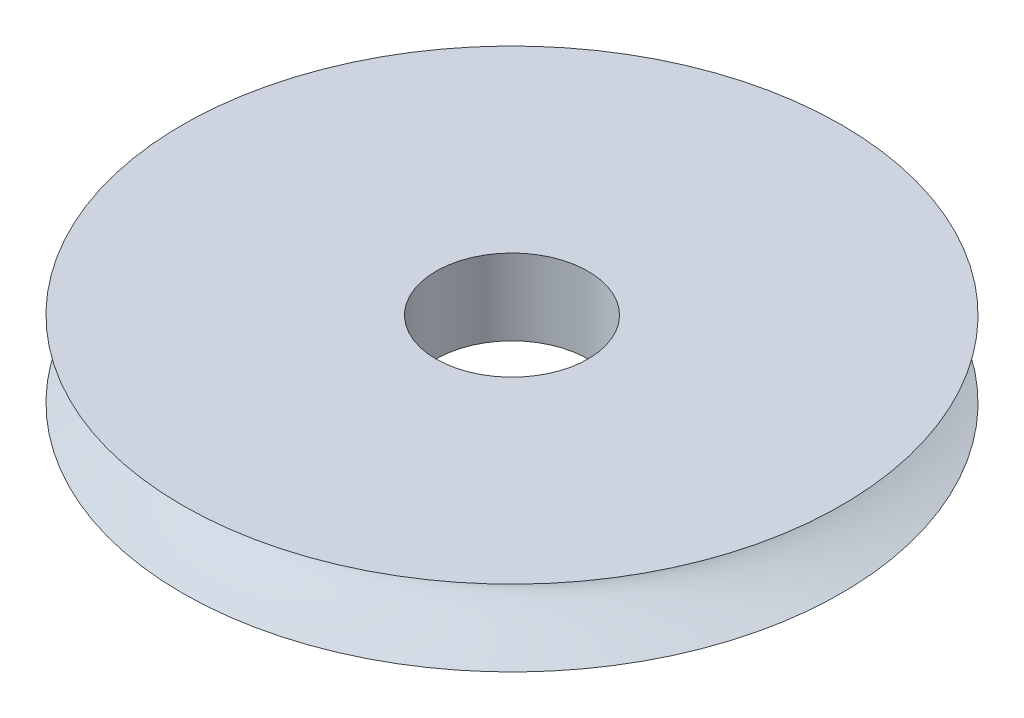
ISO-10303-21;
HEADER;
FILE_DESCRIPTION(('STEP AP214'),'2;1');
FILE_NAME('part.step','',(''),(''),'','','');
FILE_SCHEMA(('AUTOMOTIVE_DESIGN { 1 0 10303 214 1 1 1 1 }'));
ENDSEC;
DATA;
#1=APPLICATION_CONTEXT('core data for automotive mechanical design processes');
#2=APPLICATION_PROTOCOL_DEFINITION('international standard','automotive_design',2000,#1);
#3=PRODUCT_CONTEXT('',#1,'mechanical');
#4=PRODUCT('Part','Part','',(#3));
#5=PRODUCT_RELATED_PRODUCT_CATEGORY('part','',(#4));
#6=PRODUCT_DEFINITION_FORMATION('','',#4);
#7=PRODUCT_DEFINITION_CONTEXT('part definition',#1,'design');
#8=PRODUCT_DEFINITION('design','',#6,#7);
#9=PRODUCT_DEFINITION_SHAPE('','',#8);
#10=(LENGTH_UNIT() NAMED_UNIT(*) SI_UNIT(.MILLI.,.METRE.));
#11=(NAMED_UNIT(*) PLANE_ANGLE_UNIT() SI_UNIT($,.RADIAN.));
#12=(NAMED_UNIT(*) SI_UNIT($,.STERADIAN.) SOLID_ANGLE_UNIT());
#13=UNCERTAINTY_MEASURE_WITH_UNIT(LENGTH_MEASURE(1.E-05),#10,'distance_accuracy_value','');
#14=(GEOMETRIC_REPRESENTATION_CONTEXT(3) GLOBAL_UNCERTAINTY_ASSIGNED_CONTEXT((#13)) GLOBAL_UNIT_ASSIGNED_CONTEXT((#10,
#11,#12)) REPRESENTATION_CONTEXT('',''));
#15=CARTESIAN_POINT('',(0.,0.,0.));
#16=DIRECTION('',(0.,0.,1.));
#17=DIRECTION('',(1.,0.,0.));
#18=AXIS2_PLACEMENT_3D('',#15,#16,#17);
#19=CARTESIAN_POINT('',(-4.7030891410279,0.0646365379077759,0.));
#20=CARTESIAN_POINT('',(0.132127884853617,-1.29416630680979,0.));
#21=CARTESIAN_POINT('',(-4.7030891410279,-2.93536346209222,0.));
#22=B_SPLINE_CURVE_WITH_KNOTS('',2,(#19,#20,#21),.UNSPECIFIED.,.F.,.F.,(3,3),(0.,1.),.UNSPECIFIED.);
#23=CARTESIAN_POINT('',(8.2969108589721,-2.93536346209222,0.));
#24=DIRECTION('',(0.,-1.,0.));
#25=AXIS1_PLACEMENT('',#23,#24);
#26=SURFACE_OF_REVOLUTION('',#22,#25);
#27=CARTESIAN_POINT('',(0.845458704228537,-1.55002649245806,7.5654333756056));
#28=CARTESIAN_POINT('',(0.847613144882339,-1.52860845002893,7.55579344749865));
#29=CARTESIAN_POINT('',(0.849600075522715,-1.50651041165991,7.54761473258343));
#30=CARTESIAN_POINT('',(0.852998868016188,-1.46124210806276,7.53487370081712));
#31=CARTESIAN_POINT('',(0.854411277726282,-1.43807288789859,7.53030793474944));
#32=CARTESIAN_POINT('',(0.856465254339281,-1.39109551951572,7.52529166505001));
#33=CARTESIAN_POINT('',(0.857101858663785,-1.36728424364092,7.52486753444354));
#34=CARTESIAN_POINT('',(0.857494946830042,-1.31997728190922,7.52828459824152));
#35=CARTESIAN_POINT('',(0.857251871723618,-1.29648144382842,7.53212365450922));
#36=CARTESIAN_POINT('',(0.856101229430046,-1.25576533748203,7.54229606994728));
#37=CARTESIAN_POINT('',(0.855358171437151,-1.2383377642586,7.54785913782257));
#38=CARTESIAN_POINT('',(0.852272802485811,-1.1830354662139,7.56909491146743));
#39=CARTESIAN_POINT('',(0.849091146019609,-1.14671409916213,7.58873172971374));
#40=CARTESIAN_POINT('',(0.841597598067911,-1.07836451372547,7.63442285222921));
#41=CARTESIAN_POINT('',(0.837276286515073,-1.04637560736522,7.66053052913932));
#42=CARTESIAN_POINT('',(0.829318989107059,-0.99286445150994,7.71057324787126));
#43=CARTESIAN_POINT('',(0.825740534107372,-0.970585290760509,7.73372916423974));
#44=CARTESIAN_POINT('',(0.818699519316215,-0.928033804945424,7.78185244542057));
#45=CARTESIAN_POINT('',(0.815237056832219,-0.907763138237736,7.80682127811701));
#46=CARTESIAN_POINT('',(0.808693485596487,-0.868910745000397,7.85818586726802));
#47=CARTESIAN_POINT('',(0.805613456152661,-0.850333836140016,7.88458537310411));
#48=CARTESIAN_POINT('',(0.800114354004881,-0.814715840619906,7.93846871640145));
#49=CARTESIAN_POINT('',(0.797695386573212,-0.797674998863812,7.96595272577029));
#50=CARTESIAN_POINT('',(0.793529862681783,-0.762580192797241,8.02591453099929));
#51=CARTESIAN_POINT('',(0.791934654707723,-0.744746207252042,8.05853199199379));
#52=CARTESIAN_POINT('',(0.790559435902147,-0.710785993187861,8.1247400904267));
#53=CARTESIAN_POINT('',(0.790781576963576,-0.694661812099587,8.15833183460922));
#54=CARTESIAN_POINT('',(0.793802762397922,-0.664311688585677,8.22593346490742));
#55=CARTESIAN_POINT('',(0.796580655670341,-0.650071261275024,8.25993766146361));
#56=CARTESIAN_POINT('',(0.805774891559779,-0.623601932968884,8.32820246241864));
#57=CARTESIAN_POINT('',(0.81218110036756,-0.611367551333789,8.36246209151635));
#58=CARTESIAN_POINT('',(0.826921285429864,-0.593512263264308,8.41792428854368));
#59=CARTESIAN_POINT('',(0.833675564788703,-0.587115409036396,8.43928728942234));
#60=CARTESIAN_POINT('',(0.849815036081212,-0.57561190258973,8.48139609670298));
#61=CARTESIAN_POINT('',(0.85920051707298,-0.570505392242611,8.50214183501668));
#62=CARTESIAN_POINT('',(0.881261019749441,-0.561881132319172,8.54260736686681));
#63=CARTESIAN_POINT('',(0.893980104108788,-0.55838653970675,8.56230881129041));
#64=CARTESIAN_POINT('',(0.922853029254604,-0.553504068144672,8.59929858816618));
#65=CARTESIAN_POINT('',(0.938998622456848,-0.552111194522163,8.61659255277071));
#66=CARTESIAN_POINT('',(0.972096361714699,-0.551657721361647,8.64586438827078));
#67=CARTESIAN_POINT('',(0.988698322698282,-0.552328545841051,8.65823594901108));
#68=CARTESIAN_POINT('',(1.02356397586412,-0.555348945871791,8.68010707938351));
#69=CARTESIAN_POINT('',(1.0418296417878,-0.557700538650956,8.68960317842261));
#70=CARTESIAN_POINT('',(1.08433210707147,-0.564674465848236,8.70799522977592));
#71=CARTESIAN_POINT('',(1.10885578711024,-0.569736845988072,8.7160461076736));
#72=CARTESIAN_POINT('',(1.15842575832167,-0.581657464368892,8.72848159314607));
#73=CARTESIAN_POINT('',(1.18347370001974,-0.588522552025263,8.73285194417802));
#74=CARTESIAN_POINT('',(1.23086610073931,-0.602840915427567,8.73844961720431));
#75=CARTESIAN_POINT('',(1.25322177262077,-0.610159548413059,8.73995567664677));
#76=CARTESIAN_POINT('',(1.29761642817418,-0.625696629124173,8.74119318498709));
#77=CARTESIAN_POINT('',(1.31965583749703,-0.633913707266529,8.74092729892992));
#78=CARTESIAN_POINT('',(1.38543093051534,-0.659830855601542,8.73808264494328));
#79=CARTESIAN_POINT('',(1.4286029991632,-0.678728236343089,8.73343952857457));
#80=CARTESIAN_POINT('',(1.51080087290067,-0.718207871785592,8.72118407146309));
#81=CARTESIAN_POINT('',(1.54992505508168,-0.738646868607215,8.71374296433045));
#82=CARTESIAN_POINT('',(1.62636346448451,-0.782121666456655,8.69702900702482));
#83=CARTESIAN_POINT('',(1.66367547157234,-0.805160543308593,8.68775397724181));
#84=CARTESIAN_POINT('',(1.73599872934707,-0.854083567507347,8.6682882299248));
#85=CARTESIAN_POINT('',(1.77101542539189,-0.8799605602812,8.65809982624053));
#86=CARTESIAN_POINT('',(1.83813784170435,-0.93515181638098,8.63761717431699));
#87=CARTESIAN_POINT('',(1.87024928229262,-0.964459052529358,8.62732318055625));
#88=CARTESIAN_POINT('',(1.92535464723977,-1.02214818160785,8.60921829162614));
#89=CARTESIAN_POINT('',(1.94897792279159,-1.04988015351164,8.60127843376352));
#90=CARTESIAN_POINT('',(1.99187174816283,-1.10873795645774,8.58680754183967));
#91=CARTESIAN_POINT('',(2.01116904843331,-1.13984105984939,8.5802678615074));
#92=CARTESIAN_POINT('',(2.03502486726605,-1.18849782457272,8.57237128396995));
#93=CARTESIAN_POINT('',(2.04203526176733,-1.20470705837894,8.57008593934965));
#94=CARTESIAN_POINT('',(2.05609370914162,-1.24273907361728,8.56563066379317));
#95=CARTESIAN_POINT('',(2.06255182923167,-1.26481590666887,8.56369043317485));
#96=CARTESIAN_POINT('',(2.07193439423505,-1.30980278078081,8.56119116199634));
#97=CARTESIAN_POINT('',(2.07485867797927,-1.33271285979426,8.5606321844303));
#98=CARTESIAN_POINT('',(2.07686246642717,-1.37875218303235,8.56097980606015));
#99=CARTESIAN_POINT('',(2.07593214868303,-1.40188183713551,8.56189014582471));
#100=CARTESIAN_POINT('',(2.07033324326874,-1.44757184278003,8.56505573615861));
#101=CARTESIAN_POINT('',(2.06566506424636,-1.47013225627645,8.56731083970258));
#102=CARTESIAN_POINT('',(2.05372984254488,-1.51190642714684,8.57259573958001));
#103=CARTESIAN_POINT('',(2.04677698120749,-1.53122663720625,8.57552287102684));
#104=CARTESIAN_POINT('',(2.02263498386522,-1.5876472530797,8.58523853967536));
#105=CARTESIAN_POINT('',(2.00216655191576,-1.62318426324374,8.59295911611987));
#106=CARTESIAN_POINT('',(1.95542012673419,-1.69013992936949,8.60930126425947));
#107=CARTESIAN_POINT('',(1.92909770014901,-1.72152399000152,8.61792944573727));
#108=CARTESIAN_POINT('',(1.87886059640458,-1.77401880760127,8.63304897777802));
#109=CARTESIAN_POINT('',(1.85571109987601,-1.79586254710902,8.63958903025092));
#110=CARTESIAN_POINT('',(1.80756083132728,-1.83758776535923,8.65212960043833));
#111=CARTESIAN_POINT('',(1.78255875902266,-1.85746784257227,8.6581297325262));
#112=CARTESIAN_POINT('',(1.70537956133807,-1.91444861857047,8.67477526879453));
#113=CARTESIAN_POINT('',(1.65095791977118,-1.94896053729841,8.68408888031202));
#114=CARTESIAN_POINT('',(1.55237221932811,-2.00366497093029,8.69449041270083));
#115=CARTESIAN_POINT('',(1.50914503891456,-2.02526219402348,8.69707299489381));
#116=CARTESIAN_POINT('',(1.44310542423033,-2.05480176031514,8.69682027175475));
#117=CARTESIAN_POINT('',(1.42092156045647,-2.06416207876358,8.69605187450769));
#118=CARTESIAN_POINT('',(1.37623007432386,-2.08186564554393,8.69285354205937));
#119=CARTESIAN_POINT('',(1.35372207240416,-2.09020757085348,8.69042147204441));
#120=CARTESIAN_POINT('',(1.30214871666615,-2.10794215633511,8.68258801346169));
#121=CARTESIAN_POINT('',(1.27304332781717,-2.1169563500608,8.67653776318753));
#122=CARTESIAN_POINT('',(1.21535281148263,-2.13262216654731,8.66039831744537));
#123=CARTESIAN_POINT('',(1.18676648886255,-2.13928011915993,8.65032010048851));
#124=CARTESIAN_POINT('',(1.1356627030373,-2.14888740061748,8.62755611186382));
#125=CARTESIAN_POINT('',(1.11291891453227,-2.15226592211652,8.6155692393502));
#126=CARTESIAN_POINT('',(1.06926845621809,-2.15676825380748,8.58828580240586));
#127=CARTESIAN_POINT('',(1.04836019991341,-2.1578940298183,8.57299213651735));
#128=CARTESIAN_POINT('',(1.00907219990742,-2.15779006685312,8.53940198377035));
#129=CARTESIAN_POINT('',(0.990695856547494,-2.1565571926538,8.5211015297143));
#130=CARTESIAN_POINT('',(0.956925716326563,-2.15184440567764,8.48218595796847));
#131=CARTESIAN_POINT('',(0.941534539737221,-2.14836253031153,8.46156883162904));
#132=CARTESIAN_POINT('',(0.909693260794411,-2.13809555227324,8.41249544292721));
#133=CARTESIAN_POINT('',(0.894268601958043,-2.13063925560885,8.38351998381508));
#134=CARTESIAN_POINT('',(0.867892385594168,-2.11303269649454,8.32433426531728));
#135=CARTESIAN_POINT('',(0.856956208715576,-2.1028733643382,8.29412014397356));
#136=CARTESIAN_POINT('',(0.840577999353014,-2.08260523898953,8.23944403722546));
#137=CARTESIAN_POINT('',(0.834477052825953,-2.07288409617192,8.21502665941307));
#138=CARTESIAN_POINT('',(0.824263794418201,-2.05221904598495,8.16634966323214));
#139=CARTESIAN_POINT('',(0.82014854061332,-2.04127697729106,8.14208986433909));
#140=CARTESIAN_POINT('',(0.810223166527963,-2.00668926483732,8.06966516609342));
#141=CARTESIAN_POINT('',(0.806865345887525,-1.98132706397715,8.02197536075422));
#142=CARTESIAN_POINT('',(0.804502013339759,-1.92406204901199,7.92548837534036));
#143=CARTESIAN_POINT('',(0.805860484904987,-1.89180123039397,7.87690028613792));
#144=CARTESIAN_POINT('',(0.811881075943468,-1.82145602017434,7.78428339958362));
#145=CARTESIAN_POINT('',(0.816540240105217,-1.78337686199104,7.74025056402394));
#146=CARTESIAN_POINT('',(0.825662165745113,-1.7133542875156,7.67277360064962));
#147=CARTESIAN_POINT('',(0.829707109341595,-1.68337011193265,7.64725982608214));
#148=CARTESIAN_POINT('',(0.837809554272822,-1.61955088949818,7.60163718194243));
#149=CARTESIAN_POINT('',(0.841866918323442,-1.5857336829884,7.58150462725023));
#150=CARTESIAN_POINT('',(0.845458704228537,-1.55002649245806,7.5654333756056));
#151=B_SPLINE_CURVE_WITH_KNOTS('',3,(#27,#28,#29,#30,#31,#32,#33,#34,#35,#36,#37,#38,#39,#40,
#41,#42,#43,#44,#45,#46,#47,#48,#49,#50,#51,#52,#53,#54,#55,#56,#57,#58,#59,#60,#61,#62,#63,#64,
#65,#66,#67,#68,#69,#70,#71,#72,#73,#74,#75,#76,#77,#78,#79,#80,#81,#82,#83,#84,#85,#86,#87,#88,
#89,#90,#91,#92,#93,#94,#95,#96,#97,#98,#99,#100,#101,#102,#103,#104,#105,#106,#107,#108,#109,
#110,#111,#112,#113,#114,#115,#116,#117,#118,#119,#120,#121,#122,#123,#124,#125,#126,#127,#128,
#129,#130,#131,#132,#133,#134,#135,#136,#137,#138,#139,#140,#141,#142,#143,#144,#145,#146,#147,
#148,#149,#150),.UNSPECIFIED.,.T.,.F.,(4,2,2,2,2,2,2,2,2,2,2,2,2,2,2,2,2,2,2,2,2,2,2,2,2,2,2,2,
2,2,2,2,2,2,2,2,2,2,2,2,2,2,2,2,2,2,2,2,2,2,2,2,2,2,2,2,2,2,2,2,2,4),(0.,0.0706871420016077,
0.141306718582645,0.212375694109725,0.283409042161008,0.338212986953689,0.461240408455939,
0.585318473111485,0.68218620297635,0.779133258767679,0.876347984286878,0.973578181971185,
1.0851175600354,1.1967890291314,1.30754455172357,1.41799225121553,1.48774992279892,
1.55751526081371,1.62825382575587,1.69882401635973,1.76061540648898,1.82248108233152,
1.90095052543991,1.97972254036695,2.05033284359969,2.12083697137719,2.26253312174389,
2.39668572898074,2.53099874496117,2.66498063433619,2.79869270111568,2.9102703504733,
3.02113774181638,3.07447309503939,3.14342432026475,3.2123786900581,3.28150888002626,
3.35063151325578,3.41269333306107,3.53688646308262,3.66205653715787,3.75940614751299,
3.85682474485203,4.05135562155203,4.19612813286759,4.26832985195179,4.34062439402223,
4.4335297686233,4.52618363123566,4.60363918225571,4.68102711351869,4.75851798375706,
4.83607656787508,4.93649955062953,5.0372638354205,5.11809276228369,5.19880156566316,
5.36061205414784,5.53517888912928,5.70958962099135,5.82796596565427,5.94581236809042),.UNSPECIFIED.);
#152=CARTESIAN_POINT('',(0.845458704228537,-1.55002649245806,7.5654333756056));
#153=VERTEX_POINT('',#152);
#154=EDGE_CURVE('E58',#153,#153,#151,.T.);
#155=ORIENTED_EDGE('',*,*,#154,.T.);
#156=EDGE_LOOP('',(#155));
#157=FACE_BOUND('',#156,.T.);
#158=CARTESIAN_POINT('',(8.2969108589721,-2.93536346209222,0.));
#159=DIRECTION('',(0.,-1.,0.));
#160=DIRECTION('',(0.,0.,-1.));
#161=AXIS2_PLACEMENT_3D('',#158,#159,#160);
#162=CIRCLE('',#161,13.);
#163=CARTESIAN_POINT('',(8.2969108589721,-2.93536346209222,-13.));
#164=VERTEX_POINT('',#163);
#165=EDGE_CURVE('E10',#164,#164,#162,.T.);
#166=ORIENTED_EDGE('',*,*,#165,.F.);
#167=EDGE_LOOP('',(#166));
#168=FACE_BOUND('',#167,.T.);
#169=CARTESIAN_POINT('',(8.2969108589721,0.0646365379077759,0.));
#170=DIRECTION('',(0.,-1.,0.));
#171=DIRECTION('',(0.,0.,-1.));
#172=AXIS2_PLACEMENT_3D('',#169,#170,#171);
#173=CIRCLE('',#172,13.);
#174=CARTESIAN_POINT('',(8.2969108589721,0.0646365379077759,-13.));
#175=VERTEX_POINT('',#174);
#176=EDGE_CURVE('E40',#175,#175,#173,.T.);
#177=ORIENTED_EDGE('',*,*,#176,.T.);
#178=EDGE_LOOP('',(#177));
#179=FACE_BOUND('',#178,.T.);
#180=ADVANCED_FACE('F33',(#157,#168,#179),#26,.T.);
#181=CARTESIAN_POINT('',(-4.7030891410279,-2.93536346209222,0.));
#182=DIRECTION('',(0.,1.,0.));
#183=DIRECTION('',(0.,0.,1.));
#184=AXIS2_PLACEMENT_3D('',#181,#182,#183);
#185=PLANE('',#184);
#186=CARTESIAN_POINT('',(8.29691086,-2.93536346209222,0.));
#187=DIRECTION('',(0.,1.,0.));
#188=DIRECTION('',(0.,0.,1.));
#189=AXIS2_PLACEMENT_3D('',#186,#187,#188);
#190=CIRCLE('',#189,3.);
#191=CARTESIAN_POINT('',(8.29691086,-2.93536346209222,3.));
#192=VERTEX_POINT('',#191);
#193=EDGE_CURVE('E44',#192,#192,#190,.T.);
#194=ORIENTED_EDGE('',*,*,#193,.T.);
#195=EDGE_LOOP('',(#194));
#196=FACE_BOUND('',#195,.T.);
#197=ORIENTED_EDGE('',*,*,#165,.T.);
#198=EDGE_LOOP('',(#197));
#199=FACE_BOUND('',#198,.T.);
#200=ADVANCED_FACE('F83',(#196,#199),#185,.F.);
#201=CARTESIAN_POINT('',(-4.7030891410279,0.0646365379077759,0.));
#202=DIRECTION('',(0.,1.,0.));
#203=DIRECTION('',(0.,0.,1.));
#204=AXIS2_PLACEMENT_3D('',#201,#202,#203);
#205=PLANE('',#204);
#206=CARTESIAN_POINT('',(8.29691086,0.0646365379077759,0.));
#207=DIRECTION('',(0.,1.,0.));
#208=DIRECTION('',(0.,0.,1.));
#209=AXIS2_PLACEMENT_3D('',#206,#207,#208);
#210=CIRCLE('',#209,3.);
#211=CARTESIAN_POINT('',(8.29691086,0.0646365379077759,3.));
#212=VERTEX_POINT('',#211);
#213=EDGE_CURVE('E48',#212,#212,#210,.T.);
#214=ORIENTED_EDGE('',*,*,#213,.F.);
#215=EDGE_LOOP('',(#214));
#216=FACE_BOUND('',#215,.T.);
#217=ORIENTED_EDGE('',*,*,#176,.F.);
#218=EDGE_LOOP('',(#217));
#219=FACE_BOUND('',#218,.T.);
#220=ADVANCED_FACE('F80',(#216,#219),#205,.T.);
#221=CARTESIAN_POINT('',(8.29691086,-2.93536346209222,0.));
#222=DIRECTION('',(0.,1.,0.));
#223=DIRECTION('',(0.,0.,1.));
#224=AXIS2_PLACEMENT_3D('',#221,#222,#223);
#225=CYLINDRICAL_SURFACE('',#224,3.);
#226=CARTESIAN_POINT('',(7.03513969591766,-1.71714048117948,2.7217519228413));
#227=CARTESIAN_POINT('',(7.03513816297704,-1.67267819688723,2.72175181460102));
#228=CARTESIAN_POINT('',(7.03163982358819,-1.62820260481218,2.72013772029266));
#229=CARTESIAN_POINT('',(7.017862913023,-1.54054078371538,2.71368606481905));
#230=CARTESIAN_POINT('',(7.00758002533344,-1.49735539385117,2.70884645147142));
#231=CARTESIAN_POINT('',(6.98079244762096,-1.41356039005113,2.69593238094135));
#232=CARTESIAN_POINT('',(6.96429841488136,-1.3729465024997,2.68786346322292));
#233=CARTESIAN_POINT('',(6.92583378633841,-1.29525589623655,2.66844711270893));
#234=CARTESIAN_POINT('',(6.90386284801279,-1.25817939895161,2.6570994748572));
#235=CARTESIAN_POINT('',(6.85466703851343,-1.18754137457032,2.63072811885209));
#236=CARTESIAN_POINT('',(6.82731744121084,-1.15410027544241,2.61561425697402));
#237=CARTESIAN_POINT('',(6.76879921982796,-1.09279394067497,2.58186247499774));
#238=CARTESIAN_POINT('',(6.7376302411515,-1.06492922338707,2.56322422760378));
#239=CARTESIAN_POINT('',(6.67224507868876,-1.01532608901551,2.52229299624156));
#240=CARTESIAN_POINT('',(6.63800032398747,-0.99365510282576,2.49996367652804));
#241=CARTESIAN_POINT('',(6.56798651290719,-0.957571190212655,2.45206366660553));
#242=CARTESIAN_POINT('',(6.53221785237687,-0.943156391245337,2.42649381478804));
#243=CARTESIAN_POINT('',(6.4616682982451,-0.922488082217897,2.37355475589395));
#244=CARTESIAN_POINT('',(6.42689560904823,-0.91597158248041,2.3462773574706));
#245=CARTESIAN_POINT('',(6.35825736611295,-0.910463936802886,2.28988942045921));
#246=CARTESIAN_POINT('',(6.32439162395628,-0.911471215433824,2.26077926690368));
#247=CARTESIAN_POINT('',(6.2596267346338,-0.920815754631957,2.2025691204768));
#248=CARTESIAN_POINT('',(6.22866761963348,-0.928920019634143,2.17349796448729));
#249=CARTESIAN_POINT('',(6.16929468048176,-0.951851825464473,2.11541375399782));
#250=CARTESIAN_POINT('',(6.14088102619262,-0.9666798145768,2.08640070350146));
#251=CARTESIAN_POINT('',(6.0867864841669,-1.00281602811154,2.02902123511212));
#252=CARTESIAN_POINT('',(6.06114706207045,-1.02420798024741,2.00066858768218));
#253=CARTESIAN_POINT('',(6.01340656502852,-1.07276804812074,1.94600290937988));
#254=CARTESIAN_POINT('',(5.99130631721111,-1.09993751065639,1.91969035602983));
#255=CARTESIAN_POINT('',(5.95004586248023,-1.1605486498889,1.86904676596249));
#256=CARTESIAN_POINT('',(5.93104166557948,-1.19420037813298,1.84483973856375));
#257=CARTESIAN_POINT('',(5.8972562770251,-1.26610617456144,1.80067574321002));
#258=CARTESIAN_POINT('',(5.88247565173995,-1.30436085901214,1.78071934534317));
#259=CARTESIAN_POINT('',(5.85704267785995,-1.38510729606635,1.74571494011437));
#260=CARTESIAN_POINT('',(5.84645762550171,-1.42765537068162,1.73074751438583));
#261=CARTESIAN_POINT('',(5.82983550202132,-1.51528531576805,1.70697157623662));
#262=CARTESIAN_POINT('',(5.823797316552,-1.56036656249638,1.69816155479597));
#263=CARTESIAN_POINT('',(5.8164475843839,-1.65034579499315,1.6874073353373));
#264=CARTESIAN_POINT('',(5.81500036718412,-1.69520910538657,1.68526609978374));
#265=CARTESIAN_POINT('',(5.81648808605497,-1.78470138887671,1.68745514005542));
#266=CARTESIAN_POINT('',(5.81942227030039,-1.82933040085917,1.69178430559432));
#267=CARTESIAN_POINT('',(5.82952273569752,-1.91574537464649,1.70647914316169));
#268=CARTESIAN_POINT('',(5.83656510274728,-1.95757617382321,1.71666795005759));
#269=CARTESIAN_POINT('',(5.85474285587064,-2.0386056393367,1.74243002808456));
#270=CARTESIAN_POINT('',(5.86587858733079,-2.07780408323257,1.75800375357331));
#271=CARTESIAN_POINT('',(5.89233531757993,-2.1530305866724,1.7940234262829));
#272=CARTESIAN_POINT('',(5.90770744393619,-2.18901230457287,1.81452847584541));
#273=CARTESIAN_POINT('',(5.9424529755354,-2.25634765430365,1.85939006786592));
#274=CARTESIAN_POINT('',(5.96182704168083,-2.28770052023136,1.88374724632991));
#275=CARTESIAN_POINT('',(6.0049807994373,-2.34580133491504,1.93603590187738));
#276=CARTESIAN_POINT('',(6.02886773873545,-2.37239752340543,1.96404774967803));
#277=CARTESIAN_POINT('',(6.08034845969472,-2.41916742367892,2.02196696634041));
#278=CARTESIAN_POINT('',(6.10794221097749,-2.43934118809099,2.05187431966689));
#279=CARTESIAN_POINT('',(6.16633966611774,-2.47267933223162,2.11244741938538));
#280=CARTESIAN_POINT('',(6.19714272315967,-2.48584512111881,2.14311301201244));
#281=CARTESIAN_POINT('',(6.26125865654009,-2.50475677305316,2.20410432897861));
#282=CARTESIAN_POINT('',(6.29457113762372,-2.51050380204036,2.23443010598065));
#283=CARTESIAN_POINT('',(6.36204418167661,-2.51434848703171,2.29308651076501));
#284=CARTESIAN_POINT('',(6.39617004604531,-2.5126113839995,2.32144633055863));
#285=CARTESIAN_POINT('',(6.46494265093091,-2.50191838062092,2.37609380758618));
#286=CARTESIAN_POINT('',(6.49958937851579,-2.49296265920907,2.4023815161657));
#287=CARTESIAN_POINT('',(6.56812840841599,-2.46817534592703,2.45216182830332));
#288=CARTESIAN_POINT('',(6.6020236541693,-2.45237900237761,2.47566798445273));
#289=CARTESIAN_POINT('',(6.66813699725538,-2.41437119823752,2.51965754068056));
#290=CARTESIAN_POINT('',(6.70035489542266,-2.3921589778773,2.54014058232678));
#291=CARTESIAN_POINT('',(6.76264158893245,-2.34140174906433,2.57825115059778));
#292=CARTESIAN_POINT('',(6.79265417074172,-2.31273842519301,2.59581300578903));
#293=CARTESIAN_POINT('',(6.84868878268367,-2.25008546943172,2.6274875919069));
#294=CARTESIAN_POINT('',(6.87470999884976,-2.21609475396681,2.64159961965128));
#295=CARTESIAN_POINT('',(6.92199995821241,-2.14321805486686,2.66652301804427));
#296=CARTESIAN_POINT('',(6.94320724924018,-2.10427771107202,2.6772922915688));
#297=CARTESIAN_POINT('',(6.9794921760408,-2.0229070430721,2.69533329514496));
#298=CARTESIAN_POINT('',(6.99457428069624,-1.98047929052344,2.70260757582476));
#299=CARTESIAN_POINT('',(7.0157693450972,-1.90131143325628,2.71270838934119));
#300=CARTESIAN_POINT('',(7.02301534397585,-1.86494221114827,2.71610358027252));
#301=CARTESIAN_POINT('',(7.0327009990789,-1.79143188212052,2.72062531637642));
#302=CARTESIAN_POINT('',(7.0351409767622,-1.75429082699407,2.72175201328118));
#303=CARTESIAN_POINT('',(7.03513969591766,-1.71714048117948,2.7217519228413));
#304=B_SPLINE_CURVE_WITH_KNOTS('',3,(#226,#227,#228,#229,#230,#231,#232,#233,#234,#235,#236,
#237,#238,#239,#240,#241,#242,#243,#244,#245,#246,#247,#248,#249,#250,#251,#252,#253,#254,#255,
#256,#257,#258,#259,#260,#261,#262,#263,#264,#265,#266,#267,#268,#269,#270,#271,#272,#273,#274,
#275,#276,#277,#278,#279,#280,#281,#282,#283,#284,#285,#286,#287,#288,#289,#290,#291,#292,#293,
#294,#295,#296,#297,#298,#299,#300,#301,#302,#303),.UNSPECIFIED.,.T.,.F.,(4,2,2,2,2,2,2,2,2,2,2,
2,2,2,2,2,2,2,2,2,2,2,2,2,2,2,2,2,2,2,2,2,2,2,2,2,2,2,4),(0.,0.13324839168156,0.266581641449883,
0.399687148501337,0.532800981977427,0.669472510428702,0.806156737263635,0.944276813546448,
1.08236122803234,1.21570903262291,1.34902891585519,1.47812935780014,1.60723840839655,
1.73806807835185,1.86892827957208,2.00510735131951,2.1413046757178,2.27960583853402,
2.41787309542818,2.55201432580016,2.68613254089465,2.81640046411534,2.94667938150025,
3.07860518924932,3.21055280140052,3.34615842715565,3.48176294165319,3.61734017858294,
3.75289610545784,3.88547463427759,4.01804987685261,4.14994996674659,4.28186568268663,
4.41643291269091,4.5510275488583,4.68725421770951,4.8233813174425,4.93472411160027,
5.04605945815312),.UNSPECIFIED.);
#305=CARTESIAN_POINT('',(7.03513969591766,-1.71714048117948,2.7217519228413));
#306=VERTEX_POINT('',#305);
#307=EDGE_CURVE('E102',#306,#306,#304,.T.);
#308=ORIENTED_EDGE('',*,*,#307,.T.);
#309=EDGE_LOOP('',(#308));
#310=FACE_BOUND('',#309,.T.);
#311=ORIENTED_EDGE('',*,*,#193,.F.);
#312=EDGE_LOOP('',(#311));
#313=FACE_BOUND('',#312,.T.);
#314=ORIENTED_EDGE('',*,*,#213,.T.);
#315=EDGE_LOOP('',(#314));
#316=FACE_BOUND('',#315,.T.);
#317=ADVANCED_FACE('F77',(#310,#313,#316),#225,.F.);
#318=CARTESIAN_POINT('',(1.44671255625428,-1.38490343153187,8.06666005104753));
#319=DIRECTION('',(-0.646690782350745,0.0431553331036432,0.761530465081533));
#320=DIRECTION('',(0.762240587736278,0.,0.647293817680544));
#321=AXIS2_PLACEMENT_3D('',#318,#319,#320);
#322=CYLINDRICAL_SURFACE('',#321,0.8);
#323=ORIENTED_EDGE('',*,*,#154,.F.);
#324=EDGE_LOOP('',(#323));
#325=FACE_BOUND('',#324,.T.);
#326=ORIENTED_EDGE('',*,*,#307,.F.);
#327=EDGE_LOOP('',(#326));
#328=FACE_BOUND('',#327,.T.);
#329=ADVANCED_FACE('F74',(#325,#328),#322,.F.);
#330=CLOSED_SHELL('',(#180,#200,#220,#317,#329));
#331=MANIFOLD_SOLID_BREP('B2',#330);
#332=ADVANCED_BREP_SHAPE_REPRESENTATION('',(#18,#331),#14);
#333=SHAPE_DEFINITION_REPRESENTATION(#9,#332);
ENDSEC;
END-ISO-10303-21;
